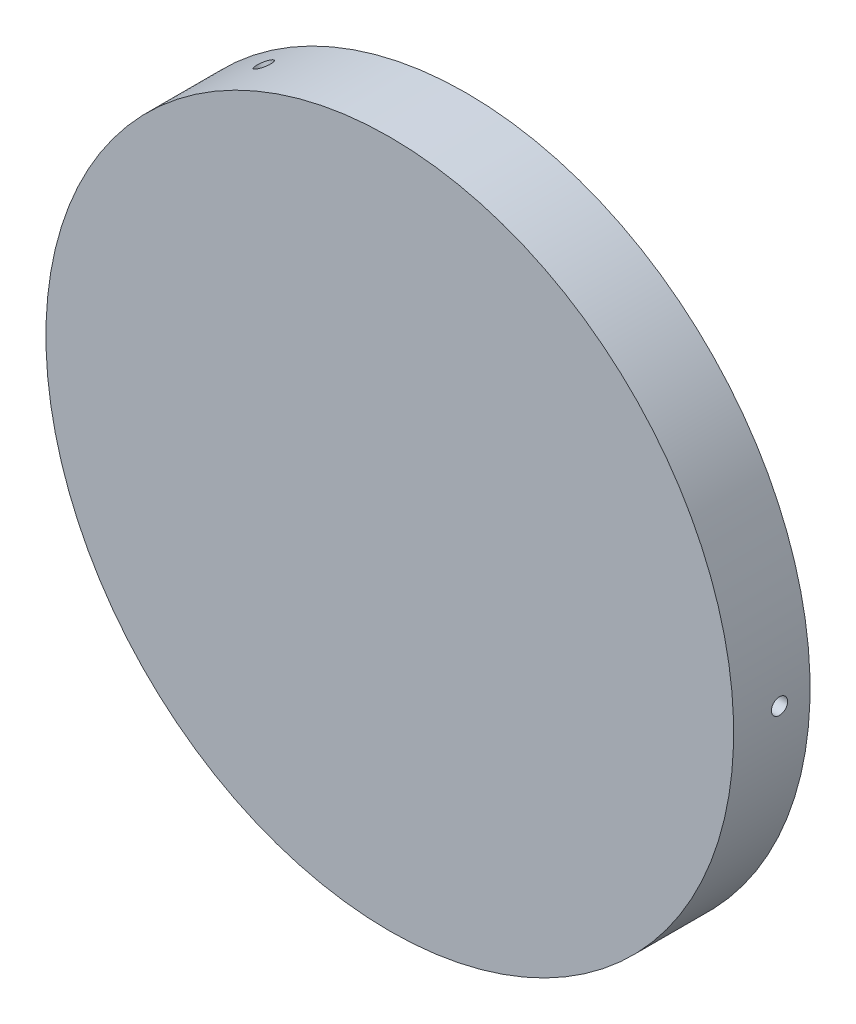
ISO-10303-21;
HEADER;
FILE_DESCRIPTION(('STEP AP214'),'2;1');
FILE_NAME('part.step','',(''),(''),'','','');
FILE_SCHEMA(('AUTOMOTIVE_DESIGN { 1 0 10303 214 1 1 1 1 }'));
ENDSEC;
DATA;
#1=APPLICATION_CONTEXT('core data for automotive mechanical design processes');
#2=APPLICATION_PROTOCOL_DEFINITION('international standard','automotive_design',2000,#1);
#3=PRODUCT_CONTEXT('',#1,'mechanical');
#4=PRODUCT('Part','Part','',(#3));
#5=PRODUCT_RELATED_PRODUCT_CATEGORY('part','',(#4));
#6=PRODUCT_DEFINITION_FORMATION('','',#4);
#7=PRODUCT_DEFINITION_CONTEXT('part definition',#1,'design');
#8=PRODUCT_DEFINITION('design','',#6,#7);
#9=PRODUCT_DEFINITION_SHAPE('','',#8);
#10=(LENGTH_UNIT() NAMED_UNIT(*) SI_UNIT(.MILLI.,.METRE.));
#11=(NAMED_UNIT(*) PLANE_ANGLE_UNIT() SI_UNIT($,.RADIAN.));
#12=(NAMED_UNIT(*) SI_UNIT($,.STERADIAN.) SOLID_ANGLE_UNIT());
#13=UNCERTAINTY_MEASURE_WITH_UNIT(LENGTH_MEASURE(1.E-05),#10,'distance_accuracy_value','');
#14=(GEOMETRIC_REPRESENTATION_CONTEXT(3) GLOBAL_UNCERTAINTY_ASSIGNED_CONTEXT((#13)) GLOBAL_UNIT_ASSIGNED_CONTEXT((#10,
#11,#12)) REPRESENTATION_CONTEXT('',''));
#15=CARTESIAN_POINT('',(0.,0.,0.));
#16=DIRECTION('',(0.,0.,1.));
#17=DIRECTION('',(1.,0.,0.));
#18=AXIS2_PLACEMENT_3D('',#15,#16,#17);
#19=CARTESIAN_POINT('',(0.,76.2,6.79450000000001));
#20=DIRECTION('',(0.,0.,-1.));
#21=DIRECTION('',(0.,1.,0.));
#22=AXIS2_PLACEMENT_3D('',#19,#20,#21);
#23=PLANE('',#22);
#24=CARTESIAN_POINT('',(0.,0.,6.79450000000001));
#25=DIRECTION('',(0.,0.,-1.));
#26=DIRECTION('',(0.,1.,0.));
#27=AXIS2_PLACEMENT_3D('',#24,#25,#26);
#28=CIRCLE('',#27,76.2);
#29=CARTESIAN_POINT('',(0.,76.2,6.79450000000001));
#30=VERTEX_POINT('',#29);
#31=EDGE_CURVE('E63',#30,#30,#28,.T.);
#32=ORIENTED_EDGE('',*,*,#31,.T.);
#33=EDGE_LOOP('',(#32));
#34=FACE_BOUND('',#33,.T.);
#35=ADVANCED_FACE('F49',(#34),#23,.T.);
#36=CARTESIAN_POINT('',(0.,0.,11.43));
#37=DIRECTION('',(0.,0.,1.));
#38=DIRECTION('',(0.,-1.,0.));
#39=AXIS2_PLACEMENT_3D('',#36,#37,#38);
#40=PLANE('',#39);
#41=CARTESIAN_POINT('',(0.,0.,11.43));
#42=DIRECTION('',(0.,0.,-1.));
#43=DIRECTION('',(0.,1.,0.));
#44=AXIS2_PLACEMENT_3D('',#41,#42,#43);
#45=CIRCLE('',#44,85.725);
#46=CARTESIAN_POINT('',(0.,85.725,11.43));
#47=VERTEX_POINT('',#46);
#48=EDGE_CURVE('E12',#47,#47,#45,.T.);
#49=ORIENTED_EDGE('',*,*,#48,.F.);
#50=EDGE_LOOP('',(#49));
#51=FACE_BOUND('',#50,.T.);
#52=ADVANCED_FACE('F102',(#51),#40,.T.);
#53=CARTESIAN_POINT('',(0.,0.,0.));
#54=DIRECTION('',(0.,0.,-1.));
#55=DIRECTION('',(0.,1.,0.));
#56=AXIS2_PLACEMENT_3D('',#53,#54,#55);
#57=CYLINDRICAL_SURFACE('',#56,85.725);
#58=CARTESIAN_POINT('',(-44.5993720145374,73.209778314846,0.));
#59=CARTESIAN_POINT('',(-44.5993678242387,73.2097811050496,0.113408084687271));
#60=CARTESIAN_POINT('',(-44.5911841319592,73.2147683160397,0.226898000483134));
#61=CARTESIAN_POINT('',(-44.5586425301309,73.2345775555205,0.450751102546283));
#62=CARTESIAN_POINT('',(-44.5342652436063,73.2494113662669,0.561110377583896));
#63=CARTESIAN_POINT('',(-44.4700037927364,73.2884424235092,0.775426808663684));
#64=CARTESIAN_POINT('',(-44.4301271456968,73.3126351308434,0.879387040019163));
#65=CARTESIAN_POINT('',(-44.3359668422572,73.369616890765,1.07797464051002));
#66=CARTESIAN_POINT('',(-44.2816867278748,73.4024038298842,1.17260429633033));
#67=CARTESIAN_POINT('',(-44.1601853265282,73.4755651358685,1.34990569922051));
#68=CARTESIAN_POINT('',(-44.0929604464497,73.5159416093072,1.43257411499175));
#69=CARTESIAN_POINT('',(-43.9474261966648,73.6030334406245,1.58357861164317));
#70=CARTESIAN_POINT('',(-43.8691163881002,73.64974904947,1.6519141248103));
#71=CARTESIAN_POINT('',(-43.7035726492111,73.7481024775171,1.77231550937872));
#72=CARTESIAN_POINT('',(-43.6163378487486,73.7997407766206,1.82437979241373));
#73=CARTESIAN_POINT('',(-43.4353800208952,73.9063894818981,1.91075029121805));
#74=CARTESIAN_POINT('',(-43.3416570145419,73.9613998771382,1.94505656456319));
#75=CARTESIAN_POINT('',(-43.1503688230264,74.073163541397,1.99493117830946));
#76=CARTESIAN_POINT('',(-43.0528043565042,74.1299164839958,2.01050300641241));
#77=CARTESIAN_POINT('',(-42.8565720748369,74.2435364689438,2.02247743124588));
#78=CARTESIAN_POINT('',(-42.7579042631691,74.300403510933,2.01888008837395));
#79=CARTESIAN_POINT('',(-42.5622902384221,74.4126319305161,1.99262127778614));
#80=CARTESIAN_POINT('',(-42.4653436880421,74.4679936042599,1.96996358822071));
#81=CARTESIAN_POINT('',(-42.2759256168745,74.5756905175208,1.9062330895291));
#82=CARTESIAN_POINT('',(-42.1834541039675,74.6280257517083,1.86516024797474));
#83=CARTESIAN_POINT('',(-42.0056389658922,74.7282567009461,1.76576102659993));
#84=CARTESIAN_POINT('',(-41.92029605763,74.7761519695331,1.70743291413252));
#85=CARTESIAN_POINT('',(-41.7592190575453,74.8662258854576,1.5751801906283));
#86=CARTESIAN_POINT('',(-41.6834849777727,74.9084045256262,1.50125556003333));
#87=CARTESIAN_POINT('',(-41.543812640108,74.985956379755,1.33988685401645));
#88=CARTESIAN_POINT('',(-41.4798772534036,75.0213279373151,1.25243949735755));
#89=CARTESIAN_POINT('',(-41.365695779219,75.0843466020223,1.06651925428704));
#90=CARTESIAN_POINT('',(-41.3154496937879,75.1119937080131,0.968046366225054));
#91=CARTESIAN_POINT('',(-41.2301232559232,75.1588646990782,0.762868548599952));
#92=CARTESIAN_POINT('',(-41.1950429939414,75.1780885339144,0.656163569943572));
#93=CARTESIAN_POINT('',(-41.1410835017767,75.2076314454089,0.437551403997643));
#94=CARTESIAN_POINT('',(-41.122204244101,75.2179505371783,0.325644225536442));
#95=CARTESIAN_POINT('',(-41.1012074718444,75.2294258633046,0.0998331559116448));
#96=CARTESIAN_POINT('',(-41.0990859292055,75.2305842996115,-0.0140702488206518));
#97=CARTESIAN_POINT('',(-41.111656743694,75.2237153703882,-0.240665742279344));
#98=CARTESIAN_POINT('',(-41.1263490891058,75.2156880112585,-0.353357831849707));
#99=CARTESIAN_POINT('',(-41.1721106460977,75.1906483752604,-0.574318952534506));
#100=CARTESIAN_POINT('',(-41.2031780318472,75.1736371001056,-0.682588475318884));
#101=CARTESIAN_POINT('',(-41.2807721171065,75.1310550017763,-0.891646130867628));
#102=CARTESIAN_POINT('',(-41.3272988350425,75.1054841683994,-0.992434254714644));
#103=CARTESIAN_POINT('',(-41.4344540616637,75.0464214387531,-1.18368921949851));
#104=CARTESIAN_POINT('',(-41.4950852662786,75.0129280281426,-1.27415408231509));
#105=CARTESIAN_POINT('',(-41.6286691355498,74.9388774099885,-1.44217468185133));
#106=CARTESIAN_POINT('',(-41.7016218214954,74.8983201902398,-1.51973039626584));
#107=CARTESIAN_POINT('',(-41.8577378902201,74.811184867263,-1.65974643551804));
#108=CARTESIAN_POINT('',(-41.9409032705315,74.764605586067,-1.72220380010855));
#109=CARTESIAN_POINT('',(-42.1150210311892,74.6666631958979,-1.83022992436545));
#110=CARTESIAN_POINT('',(-42.2059733975584,74.6153000955114,-1.87579871434475));
#111=CARTESIAN_POINT('',(-42.3930316401877,74.5091809484324,-1.94874898312774));
#112=CARTESIAN_POINT('',(-42.489136970004,74.4544252614099,-1.97613238628629));
#113=CARTESIAN_POINT('',(-42.6837545216908,74.3430244981357,-2.0119408859241));
#114=CARTESIAN_POINT('',(-42.7822667439258,74.2863794215976,-2.02036597953081));
#115=CARTESIAN_POINT('',(-42.9788674414314,74.1728081123563,-2.0180184511914));
#116=CARTESIAN_POINT('',(-43.0769560141126,74.1158819515302,-2.00725050692861));
#117=CARTESIAN_POINT('',(-43.2699600033221,74.0033693100079,-1.96683215664509));
#118=CARTESIAN_POINT('',(-43.3648754135245,73.9477828319825,-1.93718171298395));
#119=CARTESIAN_POINT('',(-43.5488696323435,73.8395759714761,-1.85984040528208));
#120=CARTESIAN_POINT('',(-43.63794833749,73.7869556415796,-1.81214922152624));
#121=CARTESIAN_POINT('',(-43.8077808895473,73.6862518910354,-1.70008261283863));
#122=CARTESIAN_POINT('',(-43.8885350472497,73.6381683010172,-1.63570781109435));
#123=CARTESIAN_POINT('',(-44.0394963655416,73.5479852321039,-1.49209056608698));
#124=CARTESIAN_POINT('',(-44.1097020764689,73.5058865757549,-1.4128460826578));
#125=CARTESIAN_POINT('',(-44.2376355442895,73.4289644138364,-1.24171760953282));
#126=CARTESIAN_POINT('',(-44.2953602026954,73.3941427148817,-1.14983049047904));
#127=CARTESIAN_POINT('',(-44.3967536374852,73.3328535829212,-0.955996817425773));
#128=CARTESIAN_POINT('',(-44.4404142058811,73.3063910285959,-0.854044434384101));
#129=CARTESIAN_POINT('',(-44.512399159174,73.26270358042,-0.643093913742305));
#130=CARTESIAN_POINT('',(-44.5407418695078,73.2454676485851,-0.534104370625822));
#131=CARTESIAN_POINT('',(-44.5737917493745,73.2253570799833,-0.353686661464282));
#132=CARTESIAN_POINT('',(-44.5833727210815,73.219523071698,-0.283430043343239));
#133=CARTESIAN_POINT('',(-44.5961641662374,73.2117328150897,-0.142126331781682));
#134=CARTESIAN_POINT('',(-44.5993746408338,73.2097765660681,-0.071079238483567));
#135=CARTESIAN_POINT('',(-44.5993720145374,73.209778314846,0.));
#136=B_SPLINE_CURVE_WITH_KNOTS('',3,(#58,#59,#60,#61,#62,#63,#64,#65,#66,#67,#68,#69,#70,#71,
#72,#73,#74,#75,#76,#77,#78,#79,#80,#81,#82,#83,#84,#85,#86,#87,#88,#89,#90,#91,#92,#93,#94,#95,
#96,#97,#98,#99,#100,#101,#102,#103,#104,#105,#106,#107,#108,#109,#110,#111,#112,#113,#114,#115,
#116,#117,#118,#119,#120,#121,#122,#123,#124,#125,#126,#127,#128,#129,#130,#131,#132,#133,#134,
#135),.UNSPECIFIED.,.T.,.F.,(4,2,2,2,2,2,2,2,2,2,2,2,2,2,2,2,2,2,2,2,2,2,2,2,2,2,2,2,2,2,2,2,2,
2,2,2,2,2,4),(0.,0.33996480919072,0.680337148942357,1.02054461114668,1.36066848890073,
1.70088691221933,2.0411188087322,2.3813839076636,2.72164790336503,3.06184854394361,
3.40204811263063,3.74218026269229,4.08231301171252,4.42247992595247,4.76264726676711,
5.10289727775879,5.44314733968129,5.78339943089101,6.12365094469981,6.46382066964296,
6.80399015756231,7.14412172432322,7.4842536964928,7.82445073493804,8.16464836118875,
8.50491263404407,8.84517629616415,9.18540394626987,9.52563164792674,9.8657764414034,
10.2059219129276,10.5460734127377,10.886212208612,11.2263977067443,11.5666675610062,
11.9071356429449,12.2471955009877,12.4602706460984,12.6733457528257),.UNSPECIFIED.);
#137=CARTESIAN_POINT('',(-44.5993720145374,73.209778314846,0.));
#138=VERTEX_POINT('',#137);
#139=EDGE_CURVE('E175',#138,#138,#136,.T.);
#140=ORIENTED_EDGE('',*,*,#139,.F.);
#141=EDGE_LOOP('',(#140));
#142=FACE_BOUND('',#141,.T.);
#143=CARTESIAN_POINT('',(-41.1018418188147,-75.2290783148454,0.));
#144=CARTESIAN_POINT('',(-41.1018463303512,-75.2290760810421,0.11340808468727));
#145=CARTESIAN_POINT('',(-41.1102572279025,-75.2244824011263,0.226898000483132));
#146=CARTESIAN_POINT('',(-41.1436833334366,-75.2062051670035,0.450751102546282));
#147=CARTESIAN_POINT('',(-41.1687184336403,-75.1925107229711,0.561110377583895));
#148=CARTESIAN_POINT('',(-41.2346510461836,-75.1563742026549,0.775426808663684));
#149=CARTESIAN_POINT('',(-41.2755408688411,-75.1339363669679,0.879387040019162));
#150=CARTESIAN_POINT('',(-41.3719686722054,-75.0808820321219,1.07797464051002));
#151=CARTESIAN_POINT('',(-41.4275030515861,-75.0502675437061,1.17260429633032));
#152=CARTESIAN_POINT('',(-41.5516133018159,-74.9816248965366,1.34990569922051));
#153=CARTESIAN_POINT('',(-41.6201927935682,-74.9435946793417,1.43257411499175));
#154=CARTESIAN_POINT('',(-41.7683836568437,-74.8611042375659,1.58357861164317));
#155=CARTESIAN_POINT('',(-41.8479954651393,-74.8166437584062,1.6519141248103));
#156=CARTESIAN_POINT('',(-42.015943901822,-74.7224553891143,1.77231550937872));
#157=CARTESIAN_POINT('',(-42.1042813808852,-74.6727269853715,1.82437979241373));
#158=CARTESIAN_POINT('',(-42.2871207828629,-74.5693372620756,1.91075029121805));
#159=CARTESIAN_POINT('',(-42.3816226857897,-74.5156759552746,1.94505656456318));
#160=CARTESIAN_POINT('',(-42.5740569540155,-74.4058973541076,1.99493117830946));
#161=CARTESIAN_POINT('',(-42.6719886773067,-74.3497805188921,2.01050300641241));
#162=CARTESIAN_POINT('',(-42.868502611483,-74.2366483703997,2.02247743124588));
#163=CARTESIAN_POINT('',(-42.9670848203175,-74.1796330599541,2.01888008837395));
#164=CARTESIAN_POINT('',(-43.1620844950766,-74.0663405549782,1.99262127778614));
#165=CARTESIAN_POINT('',(-43.2585023861247,-74.0100632164118,1.96996358822071));
#166=CARTESIAN_POINT('',(-43.4464796845017,-73.8998708114753,1.90623308952911));
#167=CARTESIAN_POINT('',(-43.5380390832746,-73.8459557492651,1.86516024797475));
#168=CARTESIAN_POINT('',(-43.7137492005975,-73.7420787971334,1.76576102659994));
#169=CARTESIAN_POINT('',(-43.7978991740461,-73.6921173048389,1.70743291413253));
#170=CARTESIAN_POINT('',(-43.9564439734974,-73.5976574887625,1.5751801906283));
#171=CARTESIAN_POINT('',(-44.0308387872668,-73.5531591718315,1.50125556003333));
#172=CARTESIAN_POINT('',(-44.1678368318853,-73.4709753062723,1.33988685401645));
#173=CARTESIAN_POINT('',(-44.230437192656,-73.4332914159656,1.25243949735755));
#174=CARTESIAN_POINT('',(-44.3421036942972,-73.3659166910337,1.06651925428704));
#175=CARTESIAN_POINT('',(-44.391169833142,-73.3362258576051,0.968046366225055));
#176=CARTESIAN_POINT('',(-44.4744245210372,-73.2857664903323,0.762868548599953));
#177=CARTESIAN_POINT('',(-44.5086129813545,-73.2649980097028,0.656163569943573));
#178=CARTESIAN_POINT('',(-44.5611776392928,-73.2330391744601,0.437551403997643));
#179=CARTESIAN_POINT('',(-44.5795538637469,-73.2218488035931,0.325644225536443));
#180=CARTESIAN_POINT('',(-44.5999901738173,-73.2094027284845,0.0998331559116454));
#181=CARTESIAN_POINT('',(-44.6020541804073,-73.2081446368175,-0.0140702488206514));
#182=CARTESIAN_POINT('',(-44.5898201059588,-73.2155968168992,-0.240665742279343));
#183=CARTESIAN_POINT('',(-44.5755220363213,-73.2243070817021,-0.353357831849705));
#184=CARTESIAN_POINT('',(-44.5309562969494,-73.2514179345747,-0.574318952534504));
#185=CARTESIAN_POINT('',(-44.5006904076399,-73.2698174422856,-0.682588475318882));
#186=CARTESIAN_POINT('',(-44.4250161861106,-73.3157248421389,-0.891646130867627));
#187=CARTESIAN_POINT('',(-44.3796078358423,-73.3432327451378,-0.992434254714642));
#188=CARTESIAN_POINT('',(-44.2748803982411,-73.4065005287168,-1.18368921949851));
#189=CARTESIAN_POINT('',(-44.2155586514856,-73.4422619868701,-1.27415408231509));
#190=CARTESIAN_POINT('',(-44.0846370003626,-73.5209237021177,-1.44217468185133));
#191=CARTESIAN_POINT('',(-44.0130370747805,-73.5638239715467,-1.51973039626584));
#192=CARTESIAN_POINT('',(-43.8595176371534,-73.6554567915128,-1.65974643551804));
#193=CARTESIAN_POINT('',(-43.7775961061919,-73.7041904829799,-1.72220380010855));
#194=CARTESIAN_POINT('',(-43.6057166278692,-73.8060096918749,-1.83022992436545));
#195=CARTESIAN_POINT('',(-43.5157586949327,-73.8590952014917,-1.87579871434475));
#196=CARTESIAN_POINT('',(-43.3303276964198,-73.9680328180564,-1.94874898312773));
#197=CARTESIAN_POINT('',(-43.2348552155485,-74.0238846316052,-1.97613238628629));
#198=CARTESIAN_POINT('',(-43.0410705487086,-74.1367279937511,-2.0119408859241));
#199=CARTESIAN_POINT('',(-42.9427583623098,-74.1937195425209,-2.02036597953081));
#200=CARTESIAN_POINT('',(-42.746102374613,-74.3071950863419,-2.0180184511914));
#201=CARTESIAN_POINT('',(-42.6477585868571,-74.3636792016917,-2.00725050692861));
#202=CARTESIAN_POINT('',(-42.4538177864472,-74.4745692386176,-1.9668321566451));
#203=CARTESIAN_POINT('',(-42.3582207792691,-74.5289751560509,-1.93718171298396));
#204=CARTESIAN_POINT('',(-42.1725137797972,-74.6342153934444,-1.85984040528208));
#205=CARTESIAN_POINT('',(-42.0824038847781,-74.6850496500892,-1.81214922152624));
#206=CARTESIAN_POINT('',(-41.9102756025218,-74.7817770792883,-1.70008261283863));
#207=CARTESIAN_POINT('',(-41.8282569132097,-74.8276704363107,-1.63570781109436));
#208=CARTESIAN_POINT('',(-41.6746754253936,-74.9133152384837,-1.49209056608698));
#209=CARTESIAN_POINT('',(-41.6031140640665,-74.9530658394629,-1.41284608265781));
#210=CARTESIAN_POINT('',(-41.4725307838208,-75.0253983916305,-1.24171760953282));
#211=CARTESIAN_POINT('',(-41.4135119787201,-75.0579785627575,-1.14983049047904));
#212=CARTESIAN_POINT('',(-41.3097373160715,-75.1151432870821,-0.955996817425775));
#213=CARTESIAN_POINT('',(-41.2649897875788,-75.139723171294,-0.854044434384104));
#214=CARTESIAN_POINT('',(-41.1911628709855,-75.1802202454479,-0.64309391374231));
#215=CARTESIAN_POINT('',(-41.1620647609917,-75.1961477866917,-0.534104370625828));
#216=CARTESIAN_POINT('',(-41.1281235577646,-75.2147145379474,-0.353686661464287));
#217=CARTESIAN_POINT('',(-41.1182806725302,-75.2200948986959,-0.283430043343243));
#218=CARTESIAN_POINT('',(-41.1051383898275,-75.2272774868479,-0.142126331781684));
#219=CARTESIAN_POINT('',(-41.1018389911804,-75.2290797148958,-0.0710792384835677));
#220=CARTESIAN_POINT('',(-41.1018418188147,-75.2290783148454,0.));
#221=B_SPLINE_CURVE_WITH_KNOTS('',3,(#143,#144,#145,#146,#147,#148,#149,#150,#151,#152,#153,
#154,#155,#156,#157,#158,#159,#160,#161,#162,#163,#164,#165,#166,#167,#168,#169,#170,#171,#172,
#173,#174,#175,#176,#177,#178,#179,#180,#181,#182,#183,#184,#185,#186,#187,#188,#189,#190,#191,
#192,#193,#194,#195,#196,#197,#198,#199,#200,#201,#202,#203,#204,#205,#206,#207,#208,#209,#210,
#211,#212,#213,#214,#215,#216,#217,#218,#219,#220),.UNSPECIFIED.,.T.,.F.,(4,2,2,2,2,2,2,2,2,2,2,
2,2,2,2,2,2,2,2,2,2,2,2,2,2,2,2,2,2,2,2,2,2,2,2,2,2,2,4),(0.,0.339964809190718,
0.680337148942357,1.02054461114668,1.36066848890073,1.70088691221932,2.0411188087322,
2.3813839076636,2.72164790336503,3.06184854394359,3.40204811263061,3.74218026269227,
4.08231301171252,4.42247992595246,4.76264726676711,5.10289727775879,5.44314733968129,
5.78339943089101,6.12365094469981,6.46382066964296,6.80399015756231,7.14412172432322,
7.4842536964928,7.82445073493804,8.16464836118875,8.50491263404408,8.84517629616415,
9.18540394626987,9.52563164792673,9.86577644140339,10.2059219129276,10.5460734127377,
10.886212208612,11.2263977067443,11.5666675610062,11.9071356429449,12.2471955009877,
12.4602706460984,12.6733457528257),.UNSPECIFIED.);
#222=CARTESIAN_POINT('',(-41.1018418188147,-75.2290783148454,0.));
#223=VERTEX_POINT('',#222);
#224=EDGE_CURVE('E183',#223,#223,#221,.T.);
#225=ORIENTED_EDGE('',*,*,#224,.F.);
#226=EDGE_LOOP('',(#225));
#227=FACE_BOUND('',#226,.T.);
#228=CARTESIAN_POINT('',(85.725,0.,-2.01929999999998));
#229=CARTESIAN_POINT('',(85.7249996791111,0.113408089609985,-2.01929497599752));
#230=CARTESIAN_POINT('',(85.7247725386513,0.226898010311604,-2.00971408428796));
#231=CARTESIAN_POINT('',(85.7238882660979,0.45075112256754,-1.97162760720214));
#232=CARTESIAN_POINT('',(85.7232306188815,0.561110402896019,-1.94309934976126));
#233=CARTESIAN_POINT('',(85.7215598186986,0.775426845159334,-1.86793176441364));
#234=CARTESIAN_POINT('',(85.7205468380921,0.87938708236265,-1.82130121613829));
#235=CARTESIAN_POINT('',(85.7182796711763,1.07797469263311,-1.71126510900137));
#236=CARTESIAN_POINT('',(85.7170255441894,1.17260435239261,-1.64786367436421));
#237=CARTESIAN_POINT('',(85.7144168541876,1.34990575075921,-1.50605971406761));
#238=CARTESIAN_POINT('',(85.7130622633615,1.43257415933347,-1.4276530249768));
#239=CARTESIAN_POINT('',(85.7104055649836,1.58357864211583,-1.25807075798137));
#240=CARTESIAN_POINT('',(85.7091034595123,1.65191414858886,-1.16689467451165));
#241=CARTESIAN_POINT('',(85.7066984699975,1.77231552621601,-0.974352881071222));
#242=CARTESIAN_POINT('',(85.7055956054231,1.82437980775804,-0.872986176808845));
#243=CARTESIAN_POINT('',(85.7037136606357,1.91075030341031,-0.66294774515637));
#244=CARTESIAN_POINT('',(85.7029345793727,1.94505657511459,-0.554276041459657));
#245=CARTESIAN_POINT('',(85.7017882156686,1.99493118534508,-0.33273377126908));
#246=CARTESIAN_POINT('',(85.7014208565827,2.01050301145943,-0.219863990320087));
#247=CARTESIAN_POINT('',(85.7011391265441,2.02247743122987,0.00688814923551193));
#248=CARTESIAN_POINT('',(85.7012247541638,2.01888008530438,0.120770504649503));
#249=CARTESIAN_POINT('',(85.7018392700195,1.99262126994566,0.346291415571218));
#250=CARTESIAN_POINT('',(85.7023680703382,1.969963581735,0.457930411623016));
#251=CARTESIAN_POINT('',(85.7038091794012,1.90623309141342,0.675819698001245));
#252=CARTESIAN_POINT('',(85.7047214888215,1.86516025684422,0.782069978829237));
#253=CARTESIAN_POINT('',(85.7068268691071,1.76576104980066,0.986177861572547));
#254=CARTESIAN_POINT('',(85.7080199681917,1.70743294302777,1.08403461859294));
#255=CARTESIAN_POINT('',(85.7105523941943,1.57518023160677,1.26856834529952));
#256=CARTESIAN_POINT('',(85.7118917212955,1.50125560740422,1.3552453009686));
#257=CARTESIAN_POINT('',(85.7145660068281,1.33988690584436,1.51498102811411));
#258=CARTESIAN_POINT('',(85.7159009641181,1.25243954596504,1.58803648357177));
#259=CARTESIAN_POINT('',(85.7184156994542,1.06651929377468,1.71842988698046));
#260=CARTESIAN_POINT('',(85.7195954774772,0.968046399823862,1.7757678325939));
#261=CARTESIAN_POINT('',(85.7216668642642,0.762868580769991,1.87309819535994));
#262=CARTESIAN_POINT('',(85.7225584713417,0.656163607494912,1.91309051100126));
#263=CARTESIAN_POINT('',(85.72395297572,0.437551453220415,1.97459225974591));
#264=CARTESIAN_POINT('',(85.7244558736797,0.325644281040438,1.99610172418254));
#265=CARTESIAN_POINT('',(85.7250161841352,0.0998332140708335,2.02002313217973));
#266=CARTESIAN_POINT('',(85.7250737036467,-0.0140701944695264,2.02243966339836));
#267=CARTESIAN_POINT('',(85.724737056313,-0.240665696329557,2.00811855922274));
#268=CARTESIAN_POINT('',(85.7243428897826,-0.353357790493221,1.99138093717517));
#269=CARTESIAN_POINT('',(85.7231473685932,-0.574318932680568,1.93923044751211));
#270=CARTESIAN_POINT('',(85.7223460592897,-0.682588471924469,1.90381966006537));
#271=CARTESIAN_POINT('',(85.7204265656647,-0.891646158357783,1.81533014719165));
#272=CARTESIAN_POINT('',(85.7193083809658,-0.992434296641154,1.7622514007327));
#273=CARTESIAN_POINT('',(85.7168808738843,-1.18368927084956,1.63992087290104));
#274=CARTESIAN_POINT('',(85.7155715150087,-1.27415413029595,1.57066600218066));
#275=CARTESIAN_POINT('',(85.7129093671785,-1.44217472211731,1.41795366675467));
#276=CARTESIAN_POINT('',(85.7115565781488,-1.51973043217284,1.33449617749378));
#277=CARTESIAN_POINT('',(85.7089597747131,-1.65974646259125,1.15572803653635));
#278=CARTESIAN_POINT('',(85.7077157816685,-1.72220382270456,1.06041506594063));
#279=CARTESIAN_POINT('',(85.7054771597823,-1.83022993909284,0.860653472150028));
#280=CARTESIAN_POINT('',(85.7044825304932,-1.87579872568079,0.756204865352948));
#281=CARTESIAN_POINT('',(85.7028549284164,-1.94874899208774,0.541148099209404));
#282=CARTESIAN_POINT('',(85.702221917393,-1.97613239479636,0.430540592434804));
#283=CARTESIAN_POINT('',(85.7013888131972,-2.01194089143025,0.206296453979267));
#284=CARTESIAN_POINT('',(85.7011887200897,-2.02036598251573,0.0926598218445963));
#285=CARTESIAN_POINT('',(85.7012440257702,-2.01801844707351,-0.134387026415892));
#286=CARTESIAN_POINT('',(85.701499313503,-2.00725050121937,-0.247797290994414));
#287=CARTESIAN_POINT('',(85.7024363679259,-1.96683215184499,-0.471199945865848));
#288=CARTESIAN_POINT('',(85.7031181354666,-1.93718171066346,-0.581192329341304));
#289=CARTESIAN_POINT('',(85.7048312805346,-1.85984041216153,-0.794639404114709));
#290=CARTESIAN_POINT('',(85.7058626642582,-1.81214923510559,-0.898093979505306));
#291=CARTESIAN_POINT('',(85.7081587203869,-1.70008264324837,-1.09552513976128));
#292=CARTESIAN_POINT('',(85.7094233840779,-1.63570785162263,-1.18950207845845));
#293=CARTESIAN_POINT('',(85.7120436984694,-1.49209061746546,-1.36532995069767));
#294=CARTESIAN_POINT('',(85.713399361653,-1.41284613247438,-1.44717921564892));
#295=CARTESIAN_POINT('',(85.716049074433,-1.24171765312842,-1.5964339443826));
#296=CARTESIAN_POINT('',(85.7173431086678,-1.14983052943191,-1.66383582150838));
#297=CARTESIAN_POINT('',(85.7197240356112,-0.955996852883849,-1.78228968505892));
#298=CARTESIAN_POINT('',(85.7208108072253,-0.854044471814003,-1.83333212516777));
#299=CARTESIAN_POINT('',(85.7226524004532,-0.643093955406751,-1.91751665098919));
#300=CARTESIAN_POINT('',(85.7234076185147,-0.534104414542344,-1.95068012596212));
#301=CARTESIAN_POINT('',(85.72429871629,-0.353686700283513,-1.98935745135704));
#302=CARTESIAN_POINT('',(85.7245605597617,-0.283430074422209,-2.00057182287603));
#303=CARTESIAN_POINT('',(85.7249113021607,-0.142126347340104,-2.01554467093943));
#304=CARTESIAN_POINT('',(85.7250002011192,-0.0710792462615693,-2.01930314882569));
#305=CARTESIAN_POINT('',(85.725,0.,-2.01929999999998));
#306=B_SPLINE_CURVE_WITH_KNOTS('',3,(#228,#229,#230,#231,#232,#233,#234,#235,#236,#237,#238,
#239,#240,#241,#242,#243,#244,#245,#246,#247,#248,#249,#250,#251,#252,#253,#254,#255,#256,#257,
#258,#259,#260,#261,#262,#263,#264,#265,#266,#267,#268,#269,#270,#271,#272,#273,#274,#275,#276,
#277,#278,#279,#280,#281,#282,#283,#284,#285,#286,#287,#288,#289,#290,#291,#292,#293,#294,#295,
#296,#297,#298,#299,#300,#301,#302,#303,#304,#305),.UNSPECIFIED.,.T.,.F.,(4,2,2,2,2,2,2,2,2,2,2,
2,2,2,2,2,2,2,2,2,2,2,2,2,2,2,2,2,2,2,2,2,2,2,2,2,2,2,4),(0.,0.339964823973832,
0.680337178187576,1.02054465725478,1.360668551612,1.70088695559462,2.04111883329406,
2.38138393945471,2.72164794203646,3.0618485915606,3.40204816882299,3.7421802726358,
4.08231297596297,4.42247987708029,4.76264720469103,5.10289723484327,5.44314731559933,
5.78339938756298,6.12365088270834,6.46382061959315,6.80399011944655,7.14412173281894,
7.48425375108581,7.82445078161747,8.16464840033071,8.50491266570005,8.84517632033239,
9.18540399036991,9.52563171137061,9.86577647119035,10.2059219094341,10.5460733763503,
10.886212139573,11.2263976575539,11.5666675312073,11.9071356044957,12.2471954543791,
12.4602706227871,12.6733457528471),.UNSPECIFIED.);
#307=CARTESIAN_POINT('',(85.725,0.,-2.01929999999998));
#308=VERTEX_POINT('',#307);
#309=EDGE_CURVE('E68',#308,#308,#306,.T.);
#310=ORIENTED_EDGE('',*,*,#309,.F.);
#311=EDGE_LOOP('',(#310));
#312=FACE_BOUND('',#311,.T.);
#313=ORIENTED_EDGE('',*,*,#48,.T.);
#314=EDGE_LOOP('',(#313));
#315=FACE_BOUND('',#314,.T.);
#316=CARTESIAN_POINT('',(0.,0.,-7.61999999999999));
#317=DIRECTION('',(0.,0.,-1.));
#318=DIRECTION('',(0.,1.,0.));
#319=AXIS2_PLACEMENT_3D('',#316,#317,#318);
#320=CIRCLE('',#319,85.725);
#321=CARTESIAN_POINT('',(0.,85.725,-7.61999999999999));
#322=VERTEX_POINT('',#321);
#323=EDGE_CURVE('E55',#322,#322,#320,.T.);
#324=ORIENTED_EDGE('',*,*,#323,.F.);
#325=EDGE_LOOP('',(#324));
#326=FACE_BOUND('',#325,.T.);
#327=ADVANCED_FACE('F80',(#142,#227,#312,#315,#326),#57,.T.);
#328=CARTESIAN_POINT('',(0.,85.725,-7.61999999999999));
#329=DIRECTION('',(0.,0.,-1.));
#330=DIRECTION('',(0.,1.,0.));
#331=AXIS2_PLACEMENT_3D('',#328,#329,#330);
#332=PLANE('',#331);
#333=ORIENTED_EDGE('',*,*,#323,.T.);
#334=EDGE_LOOP('',(#333));
#335=FACE_BOUND('',#334,.T.);
#336=CARTESIAN_POINT('',(0.,0.,-7.61999999999999));
#337=DIRECTION('',(0.,0.,-1.));
#338=DIRECTION('',(0.,1.,0.));
#339=AXIS2_PLACEMENT_3D('',#336,#337,#338);
#340=CIRCLE('',#339,76.2);
#341=CARTESIAN_POINT('',(0.,76.2,-7.61999999999999));
#342=VERTEX_POINT('',#341);
#343=EDGE_CURVE('E59',#342,#342,#340,.T.);
#344=ORIENTED_EDGE('',*,*,#343,.F.);
#345=EDGE_LOOP('',(#344));
#346=FACE_BOUND('',#345,.T.);
#347=ADVANCED_FACE('F96',(#335,#346),#332,.T.);
#348=CARTESIAN_POINT('',(0.,0.,0.));
#349=DIRECTION('',(0.,0.,-1.));
#350=DIRECTION('',(0.,1.,0.));
#351=AXIS2_PLACEMENT_3D('',#348,#349,#350);
#352=CYLINDRICAL_SURFACE('',#351,76.2);
#353=CARTESIAN_POINT('',(-39.8353848858853,64.9583105614161,0.));
#354=CARTESIAN_POINT('',(-39.835380716948,64.9583133855057,-0.113403599775641));
#355=CARTESIAN_POINT('',(-39.8272118781106,64.9633248138513,-0.22688892103621));
#356=CARTESIAN_POINT('',(-39.7947283002996,64.9832282082059,-0.450732652905747));
#357=CARTESIAN_POINT('',(-39.7703942424529,64.9981319964461,-0.561087157170559));
#358=CARTESIAN_POINT('',(-39.7062431831263,65.0373404852214,-0.775394022332637));
#359=CARTESIAN_POINT('',(-39.6664337166749,65.0616406106179,-0.879349470461597));
#360=CARTESIAN_POINT('',(-39.5724245666619,65.1188622996189,-1.07792845310298));
#361=CARTESIAN_POINT('',(-39.5182284102745,65.151781750003,-1.17255426716713));
#362=CARTESIAN_POINT('',(-39.3968998066725,65.225219820418,-1.34985380081211));
#363=CARTESIAN_POINT('',(-39.3297631735209,65.2657408992815,-1.4325236377313));
#364=CARTESIAN_POINT('',(-39.1844019260926,65.3531163868015,-1.58353200602301));
#365=CARTESIAN_POINT('',(-39.1061768718169,65.3999710467772,-1.65186996842626));
#366=CARTESIAN_POINT('',(-38.9407868695611,65.4985829969882,-1.77227921727014));
#367=CARTESIAN_POINT('',(-38.8536207742767,65.550340916339,-1.82434841264372));
#368=CARTESIAN_POINT('',(-38.6727786893682,65.6571946378583,-1.9107283614084));
#369=CARTESIAN_POINT('',(-38.5791027229826,65.7122904281114,-1.94503917818841));
#370=CARTESIAN_POINT('',(-38.3878864586911,65.8241781891963,-1.99492071754398));
#371=CARTESIAN_POINT('',(-38.2903470785032,65.8809697564326,-2.01049586335364));
#372=CARTESIAN_POINT('',(-38.0941360442412,65.9946183486873,-2.02247755647436));
#373=CARTESIAN_POINT('',(-37.9954643941412,66.0514753734754,-2.01888417104458));
#374=CARTESIAN_POINT('',(-37.7998198162048,66.1636330350261,-1.99263456792805));
#375=CARTESIAN_POINT('',(-37.7028464683572,66.2189340587195,-1.96998313348375));
#376=CARTESIAN_POINT('',(-37.5133499430524,66.3264687185999,-1.90626781791652));
#377=CARTESIAN_POINT('',(-37.4208267742619,66.3787023488134,-1.86520390093668));
#378=CARTESIAN_POINT('',(-37.2428868708771,66.4787019037159,-1.76582379266153));
#379=CARTESIAN_POINT('',(-37.1574710413547,66.5264672594961,-1.70750540842046));
#380=CARTESIAN_POINT('',(-36.9962372081485,66.6162664996325,-1.57527346117061));
#381=CARTESIAN_POINT('',(-36.9204192207285,66.6583003742766,-1.50135987173613));
#382=CARTESIAN_POINT('',(-36.7805723563862,66.7355669531245,-1.34000856855675));
#383=CARTESIAN_POINT('',(-36.7165471123222,66.7707975616838,-1.25256670252036));
#384=CARTESIAN_POINT('',(-36.6021947339007,66.8335515220942,-1.06665566874699));
#385=CARTESIAN_POINT('',(-36.5518676016771,66.8610748727448,-0.968186499292178));
#386=CARTESIAN_POINT('',(-36.4663964915267,66.9077298195874,-0.763013728889029));
#387=CARTESIAN_POINT('',(-36.4312526300886,66.926861351396,-0.656310064771599));
#388=CARTESIAN_POINT('',(-36.3771903877946,66.9562616527005,-0.437698319604144));
#389=CARTESIAN_POINT('',(-36.3582719722736,66.9665304411314,-0.325790249673725));
#390=CARTESIAN_POINT('',(-36.3372260688002,66.9779527022899,-0.0999828595506509));
#391=CARTESIAN_POINT('',(-36.3350934744682,66.9791089471255,0.0139158445074677));
#392=CARTESIAN_POINT('',(-36.347669185785,66.9722852676909,0.240503338988665));
#393=CARTESIAN_POINT('',(-36.3623774763773,66.9643053515887,0.353192130493358));
#394=CARTESIAN_POINT('',(-36.4081945083719,66.9394057732881,0.574144753712204));
#395=CARTESIAN_POINT('',(-36.4393009337143,66.9224873735535,0.682409207990138));
#396=CARTESIAN_POINT('',(-36.5169908680264,66.880126526758,0.891459001335576));
#397=CARTESIAN_POINT('',(-36.5635744008672,66.8546840665501,0.992244328867406));
#398=CARTESIAN_POINT('',(-36.6708563070126,66.7958982699518,1.18350167619911));
#399=CARTESIAN_POINT('',(-36.7315580947869,66.7625530222522,1.27397119324209));
#400=CARTESIAN_POINT('',(-36.8652862098111,66.688803315611,1.44200367590931));
#401=CARTESIAN_POINT('',(-36.9383125626941,66.6483988419873,1.51956661468925));
#402=CARTESIAN_POINT('',(-37.0945744180474,66.5615544095985,1.65960355572361));
#403=CARTESIAN_POINT('',(-37.1778124473091,66.5151129568648,1.72207381202326));
#404=CARTESIAN_POINT('',(-37.3520625698236,66.4174177868739,1.83012644798153));
#405=CARTESIAN_POINT('',(-37.4430746476017,66.366164079196,1.87570886125567));
#406=CARTESIAN_POINT('',(-37.6302298503522,66.2602245158353,1.94868533364438));
#407=CARTESIAN_POINT('',(-37.7263722875277,66.2055391200465,1.97608182425247));
#408=CARTESIAN_POINT('',(-37.9210393174225,66.094230787054,2.01191674472331));
#409=CARTESIAN_POINT('',(-38.019563909458,66.0376078504064,2.02035518002788));
#410=CARTESIAN_POINT('',(-38.2161564503242,65.9240340809747,2.01803415688697));
#411=CARTESIAN_POINT('',(-38.3142245304192,65.8670833545217,2.00728060887907));
#412=CARTESIAN_POINT('',(-38.5071629080612,65.7544742719836,1.96689301023235));
#413=CARTESIAN_POINT('',(-38.6020331992513,65.6988159184677,1.93725892206429));
#414=CARTESIAN_POINT('',(-38.7859175706656,65.5904261222771,1.85995210149422));
#415=CARTESIAN_POINT('',(-38.8749315493789,65.5376947303396,1.81227905650903));
#416=CARTESIAN_POINT('',(-39.0446229164484,65.4367418282996,1.70025007889774));
#417=CARTESIAN_POINT('',(-39.1253006118108,65.3885201521208,1.63589476094764));
#418=CARTESIAN_POINT('',(-39.2761116040182,65.2980459615012,1.49231238741618));
#419=CARTESIAN_POINT('',(-39.3462427728759,65.255794651813,1.41308233777127));
#420=CARTESIAN_POINT('',(-39.4740331414037,65.1785723869643,1.24198058184136));
#421=CARTESIAN_POINT('',(-39.5316892459715,65.1436032386113,1.1501057475752));
#422=CARTESIAN_POINT('',(-39.6329618688921,65.0820394508288,0.956290864195027));
#423=CARTESIAN_POINT('',(-39.6765697923893,65.0554499383823,0.854344702958851));
#424=CARTESIAN_POINT('',(-39.7484706586846,65.0115441431688,0.643402604322899));
#425=CARTESIAN_POINT('',(-39.7767818856838,64.9942167895729,0.534415258600233));
#426=CARTESIAN_POINT('',(-39.8098103974588,64.9739886586733,0.353948418690742));
#427=CARTESIAN_POINT('',(-39.8193892413939,64.9681175473912,0.283640582444998));
#428=CARTESIAN_POINT('',(-39.83217779236,64.9602776135049,0.142232548231383));
#429=CARTESIAN_POINT('',(-39.8353875008491,64.9583087900073,0.0711323504449148));
#430=CARTESIAN_POINT('',(-39.8353848858853,64.9583105614161,0.));
#431=B_SPLINE_CURVE_WITH_KNOTS('',3,(#353,#354,#355,#356,#357,#358,#359,#360,#361,#362,#363,
#364,#365,#366,#367,#368,#369,#370,#371,#372,#373,#374,#375,#376,#377,#378,#379,#380,#381,#382,
#383,#384,#385,#386,#387,#388,#389,#390,#391,#392,#393,#394,#395,#396,#397,#398,#399,#400,#401,
#402,#403,#404,#405,#406,#407,#408,#409,#410,#411,#412,#413,#414,#415,#416,#417,#418,#419,#420,
#421,#422,#423,#424,#425,#426,#427,#428,#429,#430),.UNSPECIFIED.,.T.,.F.,(4,2,2,2,2,2,2,2,2,2,2,
2,2,2,2,2,2,2,2,2,2,2,2,2,2,2,2,2,2,2,2,2,2,2,2,2,2,2,4),(0.,0.339951159013354,
0.680309322517454,1.02050197163868,1.36061129288481,1.70083081661724,2.04106384436334,
2.38134058517484,2.72161611135281,3.0618112873851,3.4020052697302,3.74211389469929,
4.08222318200697,4.42237571387443,4.76252882212686,5.10278654291132,5.44304431670117,
5.78330470096251,6.12356435826534,6.46372050188906,6.80387634140125,7.14398415043008,
7.48409248402434,7.82428315777471,8.1644745390762,8.50475026823166,8.8450253200591,
9.18525486727613,9.52548431683168,9.86560900608668,10.2057343714167,10.545865630787,
10.8859843594419,11.2261716225105,11.566443190563,11.9069225474395,12.2469940225693,
12.4602282634656,12.6734624555453),.UNSPECIFIED.);
#432=CARTESIAN_POINT('',(-39.8353848858853,64.9583105614161,0.));
#433=VERTEX_POINT('',#432);
#434=EDGE_CURVE('E171',#433,#433,#431,.T.);
#435=ORIENTED_EDGE('',*,*,#434,.F.);
#436=EDGE_LOOP('',(#435));
#437=FACE_BOUND('',#436,.T.);
#438=CARTESIAN_POINT('',(-36.3378546901624,-66.9776105614155,0.));
#439=CARTESIAN_POINT('',(-36.3378592203644,-66.9776083630548,-0.113403599775642));
#440=CARTESIAN_POINT('',(-36.3462836640397,-66.9730396552749,-0.22688892103621));
#441=CARTESIAN_POINT('',(-36.3797622980778,-66.9548597488621,-0.450732652905748));
#442=CARTESIAN_POINT('',(-36.4048363862297,-66.9412377307098,-0.561087157170561));
#443=CARTESIAN_POINT('',(-36.4708674632164,-66.9052855280409,-0.775394022332639));
#444=CARTESIAN_POINT('',(-36.5118167223506,-66.8829595814811,-0.8793494704616));
#445=CARTESIAN_POINT('',(-36.6083767336795,-66.8301561138822,-1.07792845310299));
#446=CARTESIAN_POINT('',(-36.6639838921844,-66.7996805908554,-1.17255426716714));
#447=CARTESIAN_POINT('',(-36.7882474285697,-66.7313259731378,-1.34985380081211));
#448=CARTESIAN_POINT('',(-36.85690802883,-66.6934444827357,-1.4325236377313));
#449=CARTESIAN_POINT('',(-37.0052580444046,-66.611245693497,-1.58353200602301));
#450=CARTESIAN_POINT('',(-37.084947897367,-66.5669281392696,-1.65186996842626));
#451=CARTESIAN_POINT('',(-37.2530433524944,-66.4730021708897,-1.77227921727014));
#452=CARTESIAN_POINT('',(-37.3414500731414,-66.4233930777001,-1.82434841264372));
#453=CARTESIAN_POINT('',(-37.5244091529202,-66.3202060988556,-1.91072836140839));
#454=CARTESIAN_POINT('',(-37.6189614901138,-66.2666282273682,-1.94503917818841));
#455=CARTESIAN_POINT('',(-37.8114672657317,-66.1569739654175,-1.99492071754398));
#456=CARTESIAN_POINT('',(-37.909419895773,-66.1008981679235,-2.01049586335364));
#457=CARTESIAN_POINT('',(-38.105947980901,-65.9877987238771,-2.02247755647436));
#458=CARTESIAN_POINT('',(-38.2045234338011,-65.9307750806513,-2.01888417104458));
#459=CARTESIAN_POINT('',(-38.3994771069012,-65.817420736821,-1.99263456792805));
#460=CARTESIAN_POINT('',(-38.4958558721987,-65.7610898659416,-1.96998313348375));
#461=CARTESIAN_POINT('',(-38.683731882095,-65.650748391039,-1.90626781791652));
#462=CARTESIAN_POINT('',(-38.7752291171869,-65.5967377915346,-1.86520390093668));
#463=CARTESIAN_POINT('',(-38.950801223792,-65.4926370923076,-1.76582379266153));
#464=CARTESIAN_POINT('',(-39.0348751500797,-65.442547491946,-1.70750540842046));
#465=CARTESIAN_POINT('',(-39.1932604898814,-65.3478145165081,-1.57527346117061));
#466=CARTESIAN_POINT('',(-39.2675718868527,-65.3031711506606,-1.50135987173612));
#467=CARTESIAN_POINT('',(-39.4044101391697,-65.2206935029246,-1.34000856855674));
#468=CARTESIAN_POINT('',(-39.4669333632048,-65.1828613193612,-1.25256670252036));
#469=CARTESIAN_POINT('',(-39.578456076319,-65.1152062348703,-1.06665566874699));
#470=CARTESIAN_POINT('',(-39.6274555632915,-65.0853833351904,-0.968186499292172));
#471=CARTESIAN_POINT('',(-39.7105954875447,-65.0346906559318,-0.763013728889023));
#472=CARTESIAN_POINT('',(-39.7447358108233,-65.0138209450435,-0.656310064771593));
#473=CARTESIAN_POINT('',(-39.7972283397788,-64.9817018204837,-0.437698319604141));
#474=CARTESIAN_POINT('',(-39.8155805791866,-64.9704523862585,-0.325790249673723));
#475=CARTESIAN_POINT('',(-39.8359954992553,-64.9579372297842,-0.0999828595506496));
#476=CARTESIAN_POINT('',(-39.8380631338219,-64.9566684713346,0.0139158445074697));
#477=CARTESIAN_POINT('',(-39.8258657984258,-64.9641475170883,0.240503338988668));
#478=CARTESIAN_POINT('',(-39.8116008430651,-64.9728953123363,0.35319213049336));
#479=CARTESIAN_POINT('',(-39.7671286597159,-65.0001242368194,0.574144753712207));
#480=CARTESIAN_POINT('',(-39.7369236830832,-65.0186039915196,0.682409207990141));
#481=CARTESIAN_POINT('',(-39.6613931464765,-65.0647050248544,0.891459001335579));
#482=CARTESIAN_POINT('',(-39.6160675631813,-65.0923263175886,0.992244328867409));
#483=CARTESIAN_POINT('',(-39.5115166168727,-65.1558422753778,1.18350167619911));
#484=CARTESIAN_POINT('',(-39.4522878913821,-65.1917389417957,1.27397119324208));
#485=CARTESIAN_POINT('',(-39.3215547143971,-65.2706760332862,1.4420036759093));
#486=CARTESIAN_POINT('',(-39.250050237371,-65.3137164732168,1.51956661468926));
#487=CARTESIAN_POINT('',(-39.0967098250684,-65.4056209934009,1.65960355572361));
#488=CARTESIAN_POINT('',(-39.0148713325815,-65.4544865149355,1.72207381202326));
#489=CARTESIAN_POINT('',(-38.8431397722852,-65.5565439626503,1.83012644798153));
#490=CARTESIAN_POINT('',(-38.7532467205089,-65.6097358802183,1.87570886125568));
#491=CARTESIAN_POINT('',(-38.5679227659974,-65.7188472585703,1.94868533364438));
#492=CARTESIAN_POINT('',(-38.4724926054406,-65.7747663536517,1.97608182425247));
#493=CARTESIAN_POINT('',(-38.2787632464688,-65.8876987803236,2.01191674472331));
#494=CARTESIAN_POINT('',(-38.1804640488774,-65.9447121116,2.02035518002788));
#495=CARTESIAN_POINT('',(-37.9838100089128,-66.0581793614688,2.01803415688697));
#496=CARTESIAN_POINT('',(-37.885455192993,-66.114633446905,2.00728060887907));
#497=CARTESIAN_POINT('',(-37.6914636779972,-66.2254184420388,1.96689301023235));
#498=CARTESIAN_POINT('',(-37.5958269843245,-66.279749347516,1.93725892206429));
#499=CARTESIAN_POINT('',(-37.4100164816053,-66.3848029864244,1.85995210149422));
#500=CARTESIAN_POINT('',(-37.3198427672539,-66.4355256573132,1.81227905650903));
#501=CARTESIAN_POINT('',(-37.1475693059667,-66.5320062409784,1.70025007889774));
#502=CARTESIAN_POINT('',(-37.0654692617016,-66.5777643365916,1.63589476094765));
#503=CARTESIAN_POINT('',(-36.9117108181345,-66.6631333917033,1.49231238741619));
#504=CARTESIAN_POINT('',(-36.8400545261725,-66.7027431106871,1.41308233777128));
#505=CARTESIAN_POINT('',(-36.7092828988119,-66.7748016837668,1.24198058184137));
#506=CARTESIAN_POINT('',(-36.6501706757055,-66.8072487608293,1.1501057475752));
#507=CARTESIAN_POINT('',(-36.5462185600725,-66.8641715310951,0.95629086419502));
#508=CARTESIAN_POINT('',(-36.5013874050709,-66.8886423444267,0.854344702958844));
#509=CARTESIAN_POINT('',(-36.427413437895,-66.9289574235858,0.643402604322894));
#510=CARTESIAN_POINT('',(-36.398251896001,-66.9448119885815,0.534415258600228));
#511=CARTESIAN_POINT('',(-36.3642195648834,-66.963301453378,0.353948418690738));
#512=CARTESIAN_POINT('',(-36.3543456113971,-66.9686614199237,0.283640582444995));
#513=CARTESIAN_POINT('',(-36.3411617540045,-66.9758166629947,0.142232548231382));
#514=CARTESIAN_POINT('',(-36.3378518485955,-66.9776119403362,0.0711323504449139));
#515=CARTESIAN_POINT('',(-36.3378546901624,-66.9776105614155,0.));
#516=B_SPLINE_CURVE_WITH_KNOTS('',3,(#438,#439,#440,#441,#442,#443,#444,#445,#446,#447,#448,
#449,#450,#451,#452,#453,#454,#455,#456,#457,#458,#459,#460,#461,#462,#463,#464,#465,#466,#467,
#468,#469,#470,#471,#472,#473,#474,#475,#476,#477,#478,#479,#480,#481,#482,#483,#484,#485,#486,
#487,#488,#489,#490,#491,#492,#493,#494,#495,#496,#497,#498,#499,#500,#501,#502,#503,#504,#505,
#506,#507,#508,#509,#510,#511,#512,#513,#514,#515),.UNSPECIFIED.,.T.,.F.,(4,2,2,2,2,2,2,2,2,2,2,
2,2,2,2,2,2,2,2,2,2,2,2,2,2,2,2,2,2,2,2,2,2,2,2,2,2,2,4),(0.,0.339951159013356,
0.680309322517455,1.02050197163868,1.36061129288481,1.70083081661724,2.04106384436334,
2.38134058517484,2.72161611135281,3.0618112873851,3.40200526973021,3.7421138946993,
4.08222318200696,4.42237571387444,4.76252882212687,5.10278654291133,5.44304431670118,
5.78330470096252,6.12356435826535,6.46372050188907,6.80387634140126,7.14398415043009,
7.48409248402435,7.82428315777471,8.1644745390762,8.50475026823168,8.84502532005912,
9.18525486727614,9.52548431683169,9.86560900608671,10.2057343714167,10.545865630787,
10.8859843594419,11.2261716225105,11.566443190563,11.9069225474395,12.2469940225693,
12.4602282634656,12.6734624555453),.UNSPECIFIED.);
#517=CARTESIAN_POINT('',(-36.3378546901624,-66.9776105614155,0.));
#518=VERTEX_POINT('',#517);
#519=EDGE_CURVE('E179',#518,#518,#516,.T.);
#520=ORIENTED_EDGE('',*,*,#519,.F.);
#521=EDGE_LOOP('',(#520));
#522=FACE_BOUND('',#521,.T.);
#523=CARTESIAN_POINT('',(76.2,0.,-2.01929999999998));
#524=CARTESIAN_POINT('',(76.1999996392258,-0.113403607660446,-2.01929497755679));
#525=CARTESIAN_POINT('',(76.1997441266179,-0.226888936778631,-2.00971484014415));
#526=CARTESIAN_POINT('',(76.1987493994887,-0.450732684974426,-1.97163153379925));
#527=CARTESIAN_POINT('',(76.1980096062252,-0.561087197714024,-1.94310572314302));
#528=CARTESIAN_POINT('',(76.1961301032578,-0.775394080789464,-1.86794501922326));
#529=CARTESIAN_POINT('',(76.1949905882015,-0.879349538285202,-1.8213189388516));
#530=CARTESIAN_POINT('',(76.1924402009908,-1.07792853659164,-1.71129376244));
#531=CARTESIAN_POINT('',(76.1910293953722,-1.17255435696599,-1.64789877765378));
#532=CARTESIAN_POINT('',(76.1880946888645,-1.34985388336662,-1.50610607808008));
#533=CARTESIAN_POINT('',(76.1865707514971,-1.43252370875846,-1.4277035112849));
#534=CARTESIAN_POINT('',(76.1835818626162,-1.58353205483586,-1.25812924429154));
#535=CARTESIAN_POINT('',(76.1821169134465,-1.65187000651683,-1.16695703735222));
#536=CARTESIAN_POINT('',(76.1794110452616,-1.772279244241,-0.974419125007024));
#537=CARTESIAN_POINT('',(76.1781701550816,-1.82434843722207,-0.873052110200829));
#538=CARTESIAN_POINT('',(76.1760526323988,-1.91072838093653,-0.663011404909893));
#539=CARTESIAN_POINT('',(76.1751759985953,-1.94503919508802,-0.554337740519962));
#540=CARTESIAN_POINT('',(76.1738860785796,-1.99492072881381,-0.332795709852241));
#541=CARTESIAN_POINT('',(76.1734726830094,-2.01049587143932,-0.219928340098325));
#542=CARTESIAN_POINT('',(76.1731555217214,-2.02247755645161,0.00681970600345268));
#543=CARTESIAN_POINT('',(76.1732517542144,-2.01888416613098,0.120700378792637));
#544=CARTESIAN_POINT('',(76.1739428952076,-1.9926345553713,0.346212362335299));
#545=CARTESIAN_POINT('',(76.1745376784511,-1.96998312309533,0.457844230868136));
#546=CARTESIAN_POINT('',(76.1761586725566,-1.9062678209301,0.675720314687997));
#547=CARTESIAN_POINT('',(76.17718488426,-1.86520391513577,0.781964519468406));
#548=CARTESIAN_POINT('',(76.1795531928999,-1.76582382981291,0.986064743758526));
#549=CARTESIAN_POINT('',(76.1808953300328,-1.70750545469446,1.08391969371057));
#550=CARTESIAN_POINT('',(76.1837441443919,-1.57527352680387,1.26845190079416));
#551=CARTESIAN_POINT('',(76.1852508218969,-1.50135994761197,1.3551291389892));
#552=CARTESIAN_POINT('',(76.188259423403,-1.34000865157599,1.51487337751612));
#553=CARTESIAN_POINT('',(76.1897613457988,-1.25256678038092,1.58793618179976));
#554=CARTESIAN_POINT('',(76.1925906735361,-1.06665573199764,1.71834524876181));
#555=CARTESIAN_POINT('',(76.1939180788507,-0.968186553108583,1.77569150901612));
#556=CARTESIAN_POINT('',(76.1962487476379,-0.763013780412183,1.87303914221282));
#557=CARTESIAN_POINT('',(76.1972520086817,-0.656310124911828,1.91304038519082));
#558=CARTESIAN_POINT('',(76.1988212522535,-0.43769839843459,1.97455981426969));
#559=CARTESIAN_POINT('',(76.1993872357145,-0.32579033856303,1.99607803980829));
#560=CARTESIAN_POINT('',(76.2000180029792,-0.0999829526988079,2.02001546827));
#561=CARTESIAN_POINT('',(76.2000829391333,0.0139157574509686,2.02244047675215));
#562=CARTESIAN_POINT('',(76.1997046951048,0.240503265373035,2.00813775978229));
#563=CARTESIAN_POINT('',(76.1992615153765,0.353192064226981,1.99141005145417));
#564=CARTESIAN_POINT('',(76.1979170887019,0.574144721881553,1.93928154740899));
#565=CARTESIAN_POINT('',(76.1970159063692,0.682409202525425,1.90388338564009));
#566=CARTESIAN_POINT('',(76.1948570355346,0.891459045345961,1.81542148198533));
#567=CARTESIAN_POINT('',(76.1935993464835,0.992244396005058,1.76235771289581));
#568=CARTESIAN_POINT('',(76.1908687881619,1.18350175844558,1.64005593511156));
#569=CARTESIAN_POINT('',(76.1893958669246,1.27397127009836,1.57081401785469));
#570=CARTESIAN_POINT('',(76.1864010292724,1.44200374042209,1.41812721646699));
#571=CARTESIAN_POINT('',(76.1848791127556,1.51956667222591,1.33468230277106));
#572=CARTESIAN_POINT('',(76.1819574245753,1.65960359910839,1.15593335337388));
#573=CARTESIAN_POINT('',(76.1805576832902,1.72207384823061,1.06062638242246));
#574=CARTESIAN_POINT('',(76.1780386377018,1.83012647157509,0.860873773177885));
#575=CARTESIAN_POINT('',(76.1769193328402,1.87570887941298,0.756428153075926));
#576=CARTESIAN_POINT('',(76.1750875748169,1.94868534799663,0.54137720736578));
#577=CARTESIAN_POINT('',(76.1743750673198,1.97608183788698,0.430772706556795));
#578=CARTESIAN_POINT('',(76.1734370838718,2.01191675355131,0.206531926005989));
#579=CARTESIAN_POINT('',(76.1732116077796,2.0203551848196,0.0928956471428321));
#580=CARTESIAN_POINT('',(76.1732731287518,2.01803415030132,-0.134145364482517));
#581=CARTESIAN_POINT('',(76.1735599679137,2.00728059974074,-0.247550157806789));
#582=CARTESIAN_POINT('',(76.174613451382,1.96689300253854,-0.470944197735606));
#583=CARTESIAN_POINT('',(76.1753800966429,1.93725891833424,-0.580933437544477));
#584=CARTESIAN_POINT('',(76.1773067467044,1.85995211248792,-0.794376835597361));
#585=CARTESIAN_POINT('',(76.1784667583221,1.81227907823323,-0.897830880551038));
#586=CARTESIAN_POINT('',(76.1810493166548,1.70025012758233,-1.09526433501755));
#587=CARTESIAN_POINT('',(76.1824718536965,1.63589482584294,-1.18924409343257));
#588=CARTESIAN_POINT('',(76.185419511612,1.49231246970152,-1.36508734099433));
#589=CARTESIAN_POINT('',(76.1869446531241,1.41308241756089,-1.44694838187327));
#590=CARTESIAN_POINT('',(76.1899257704767,1.24198065167911,-1.59622924325982));
#591=CARTESIAN_POINT('',(76.1913817290831,1.15010580998298,-1.66364547995778));
#592=CARTESIAN_POINT('',(76.1940607935142,0.95629092100248,-1.78213204965097));
#593=CARTESIAN_POINT('',(76.1952837566339,0.854344762914773,-1.83319237795241));
#594=CARTESIAN_POINT('',(76.1973563305331,0.643402671039966,-1.91741325792515));
#595=CARTESIAN_POINT('',(76.198206386819,0.53441532891293,-1.95059517955284));
#596=CARTESIAN_POINT('',(76.1992098847108,0.353948480834067,-1.98931278411947));
#597=CARTESIAN_POINT('',(76.1995048943707,0.28364063219719,-2.00054386592863));
#598=CARTESIAN_POINT('',(76.1999000651408,0.142232573137594,-2.0155390481778));
#599=CARTESIAN_POINT('',(76.2000002262954,0.0711323628960641,-2.01930315032526));
#600=CARTESIAN_POINT('',(76.2,0.,-2.01929999999998));
#601=B_SPLINE_CURVE_WITH_KNOTS('',3,(#523,#524,#525,#526,#527,#528,#529,#530,#531,#532,#533,
#534,#535,#536,#537,#538,#539,#540,#541,#542,#543,#544,#545,#546,#547,#548,#549,#550,#551,#552,
#553,#554,#555,#556,#557,#558,#559,#560,#561,#562,#563,#564,#565,#566,#567,#568,#569,#570,#571,
#572,#573,#574,#575,#576,#577,#578,#579,#580,#581,#582,#583,#584,#585,#586,#587,#588,#589,#590,
#591,#592,#593,#594,#595,#596,#597,#598,#599,#600),.UNSPECIFIED.,.T.,.F.,(4,2,2,2,2,2,2,2,2,2,2,
2,2,2,2,2,2,2,2,2,2,2,2,2,2,2,2,2,2,2,2,2,2,2,2,2,2,2,4),(0.,0.339951182691978,
0.680309369360372,1.02050204549131,1.36061139333122,1.70083088609212,2.04106388370372,
2.38134063608871,2.72161617328124,3.06181136365072,3.40200535973994,3.74211391063558,
4.08222312475967,4.42237563559363,4.7625287226828,5.10278647416799,5.44304427813433,
5.78330463157252,6.12356425898565,6.46372042171441,6.80387628031971,7.14398416401342,
7.48409257144913,7.82428323254612,8.16447460179618,8.50475031893419,8.84502535874209,
9.18525493789801,9.52548441845028,9.86560905382598,10.2057343658791,10.5458655725297,
10.8859842488536,11.226171543707,11.5664431428116,11.9069224858647,12.2469939479571,
12.4602282261478,12.673462455579),.UNSPECIFIED.);
#602=CARTESIAN_POINT('',(76.2,0.,-2.01929999999998));
#603=VERTEX_POINT('',#602);
#604=EDGE_CURVE('E75',#603,#603,#601,.T.);
#605=ORIENTED_EDGE('',*,*,#604,.F.);
#606=EDGE_LOOP('',(#605));
#607=FACE_BOUND('',#606,.T.);
#608=ORIENTED_EDGE('',*,*,#343,.T.);
#609=EDGE_LOOP('',(#608));
#610=FACE_BOUND('',#609,.T.);
#611=ORIENTED_EDGE('',*,*,#31,.F.);
#612=EDGE_LOOP('',(#611));
#613=FACE_BOUND('',#612,.T.);
#614=ADVANCED_FACE('F88',(#437,#522,#607,#610,#613),#352,.F.);
#615=CARTESIAN_POINT('',(85.725,0.,0.));
#616=DIRECTION('',(1.,0.,0.));
#617=DIRECTION('',(0.,0.,-1.));
#618=AXIS2_PLACEMENT_3D('',#615,#616,#617);
#619=CYLINDRICAL_SURFACE('',#618,2.01929999999998);
#620=ORIENTED_EDGE('',*,*,#309,.T.);
#621=EDGE_LOOP('',(#620));
#622=FACE_BOUND('',#621,.T.);
#623=ORIENTED_EDGE('',*,*,#604,.T.);
#624=EDGE_LOOP('',(#623));
#625=FACE_BOUND('',#624,.T.);
#626=ADVANCED_FACE('F83',(#622,#625),#619,.F.);
#627=CARTESIAN_POINT('',(-42.8625000000004,-74.2400277394208,0.));
#628=DIRECTION('',(-0.500000000000004,-0.866025403784436,0.));
#629=DIRECTION('',(0.866025403784436,-0.500000000000004,0.));
#630=AXIS2_PLACEMENT_3D('',#627,#628,#629);
#631=CYLINDRICAL_SURFACE('',#630,2.01929999999998);
#632=ORIENTED_EDGE('',*,*,#224,.T.);
#633=EDGE_LOOP('',(#632));
#634=FACE_BOUND('',#633,.T.);
#635=ORIENTED_EDGE('',*,*,#519,.T.);
#636=EDGE_LOOP('',(#635));
#637=FACE_BOUND('',#636,.T.);
#638=ADVANCED_FACE('F87',(#634,#637),#631,.F.);
#639=CARTESIAN_POINT('',(-42.8624999999993,74.2400277394214,0.));
#640=DIRECTION('',(-0.499999999999992,0.866025403784443,0.));
#641=DIRECTION('',(-0.866025403784443,-0.499999999999992,0.));
#642=AXIS2_PLACEMENT_3D('',#639,#640,#641);
#643=CYLINDRICAL_SURFACE('',#642,2.01929999999998);
#644=ORIENTED_EDGE('',*,*,#139,.T.);
#645=EDGE_LOOP('',(#644));
#646=FACE_BOUND('',#645,.T.);
#647=ORIENTED_EDGE('',*,*,#434,.T.);
#648=EDGE_LOOP('',(#647));
#649=FACE_BOUND('',#648,.T.);
#650=ADVANCED_FACE('F140',(#646,#649),#643,.F.);
#651=CLOSED_SHELL('',(#35,#52,#327,#347,#614,#626,#638,#650));
#652=MANIFOLD_SOLID_BREP('B2',#651);
#653=ADVANCED_BREP_SHAPE_REPRESENTATION('',(#18,#652),#14);
#654=SHAPE_DEFINITION_REPRESENTATION(#9,#653);
ENDSEC;
END-ISO-10303-21;
